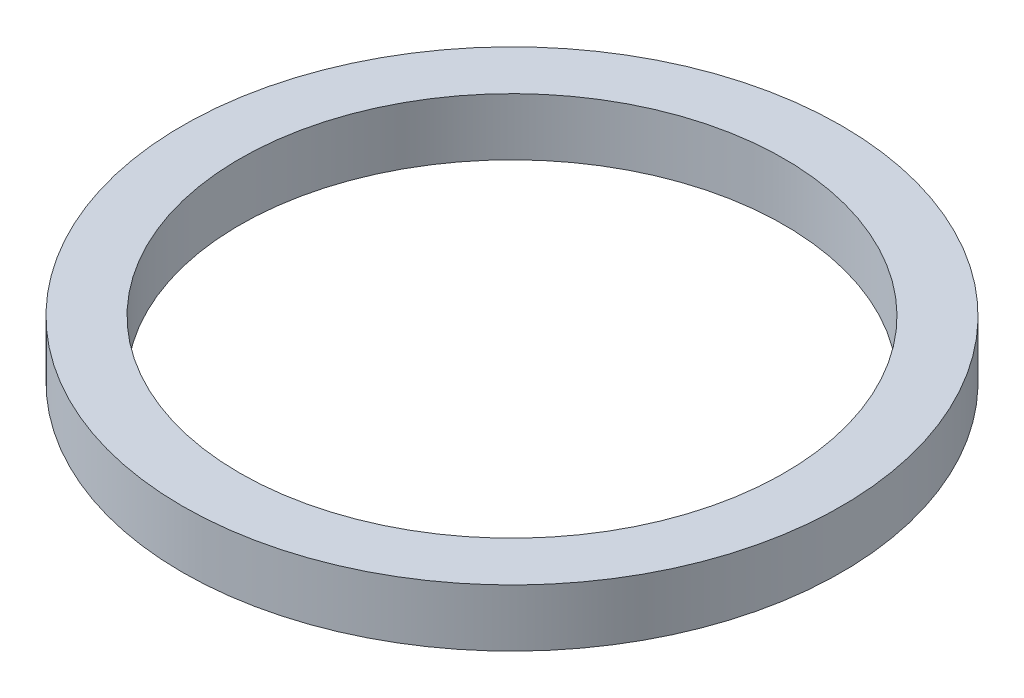
ISO-10303-21;
HEADER;
FILE_DESCRIPTION(('STEP AP214'),'2;1');
FILE_NAME('part.step','',(''),(''),'','','');
FILE_SCHEMA(('AUTOMOTIVE_DESIGN { 1 0 10303 214 1 1 1 1 }'));
ENDSEC;
DATA;
#1=APPLICATION_CONTEXT('core data for automotive mechanical design processes');
#2=APPLICATION_PROTOCOL_DEFINITION('international standard','automotive_design',2000,#1);
#3=PRODUCT_CONTEXT('',#1,'mechanical');
#4=PRODUCT('Part','Part','',(#3));
#5=PRODUCT_RELATED_PRODUCT_CATEGORY('part','',(#4));
#6=PRODUCT_DEFINITION_FORMATION('','',#4);
#7=PRODUCT_DEFINITION_CONTEXT('part definition',#1,'design');
#8=PRODUCT_DEFINITION('design','',#6,#7);
#9=PRODUCT_DEFINITION_SHAPE('','',#8);
#10=(LENGTH_UNIT() NAMED_UNIT(*) SI_UNIT(.MILLI.,.METRE.));
#11=(NAMED_UNIT(*) PLANE_ANGLE_UNIT() SI_UNIT($,.RADIAN.));
#12=(NAMED_UNIT(*) SI_UNIT($,.STERADIAN.) SOLID_ANGLE_UNIT());
#13=UNCERTAINTY_MEASURE_WITH_UNIT(LENGTH_MEASURE(1.E-05),#10,'distance_accuracy_value','');
#14=(GEOMETRIC_REPRESENTATION_CONTEXT(3) GLOBAL_UNCERTAINTY_ASSIGNED_CONTEXT((#13)) GLOBAL_UNIT_ASSIGNED_CONTEXT((#10,
#11,#12)) REPRESENTATION_CONTEXT('',''));
#15=CARTESIAN_POINT('',(0.,0.,0.));
#16=DIRECTION('',(0.,0.,1.));
#17=DIRECTION('',(1.,0.,0.));
#18=AXIS2_PLACEMENT_3D('',#15,#16,#17);
#19=CARTESIAN_POINT('',(0.,10.,0.));
#20=DIRECTION('',(0.,-1.,0.));
#21=DIRECTION('',(0.,0.,-1.));
#22=AXIS2_PLACEMENT_3D('',#19,#20,#21);
#23=CYLINDRICAL_SURFACE('',#22,57.5);
#24=CARTESIAN_POINT('',(0.,10.,0.));
#25=DIRECTION('',(0.,1.,0.));
#26=DIRECTION('',(0.,0.,1.));
#27=AXIS2_PLACEMENT_3D('',#24,#25,#26);
#28=CIRCLE('',#27,57.5);
#29=CARTESIAN_POINT('',(0.,10.,57.5));
#30=VERTEX_POINT('',#29);
#31=EDGE_CURVE('E10',#30,#30,#28,.T.);
#32=ORIENTED_EDGE('',*,*,#31,.F.);
#33=EDGE_LOOP('',(#32));
#34=FACE_BOUND('',#33,.T.);
#35=CARTESIAN_POINT('',(0.,0.,0.));
#36=DIRECTION('',(0.,1.,0.));
#37=DIRECTION('',(0.,0.,1.));
#38=AXIS2_PLACEMENT_3D('',#35,#36,#37);
#39=CIRCLE('',#38,57.5);
#40=CARTESIAN_POINT('',(0.,0.,57.5));
#41=VERTEX_POINT('',#40);
#42=EDGE_CURVE('E37',#41,#41,#39,.T.);
#43=ORIENTED_EDGE('',*,*,#42,.T.);
#44=EDGE_LOOP('',(#43));
#45=FACE_BOUND('',#44,.T.);
#46=ADVANCED_FACE('F40',(#34,#45),#23,.T.);
#47=CARTESIAN_POINT('',(0.,10.,0.));
#48=DIRECTION('',(0.,1.,0.));
#49=DIRECTION('',(0.,0.,1.));
#50=AXIS2_PLACEMENT_3D('',#47,#48,#49);
#51=PLANE('',#50);
#52=CARTESIAN_POINT('',(0.,10.,0.));
#53=DIRECTION('',(0.,1.,0.));
#54=DIRECTION('',(0.,0.,1.));
#55=AXIS2_PLACEMENT_3D('',#52,#53,#54);
#56=CIRCLE('',#55,47.5);
#57=CARTESIAN_POINT('',(0.,10.,47.5));
#58=VERTEX_POINT('',#57);
#59=EDGE_CURVE('E50',#58,#58,#56,.T.);
#60=ORIENTED_EDGE('',*,*,#59,.F.);
#61=EDGE_LOOP('',(#60));
#62=FACE_BOUND('',#61,.T.);
#63=ORIENTED_EDGE('',*,*,#31,.T.);
#64=EDGE_LOOP('',(#63));
#65=FACE_BOUND('',#64,.T.);
#66=ADVANCED_FACE('F59',(#62,#65),#51,.T.);
#67=CARTESIAN_POINT('',(0.,0.,0.));
#68=DIRECTION('',(0.,1.,0.));
#69=DIRECTION('',(0.,0.,1.));
#70=AXIS2_PLACEMENT_3D('',#67,#68,#69);
#71=PLANE('',#70);
#72=CARTESIAN_POINT('',(0.,0.,0.));
#73=DIRECTION('',(0.,1.,0.));
#74=DIRECTION('',(0.,0.,1.));
#75=AXIS2_PLACEMENT_3D('',#72,#73,#74);
#76=CIRCLE('',#75,47.5);
#77=CARTESIAN_POINT('',(0.,0.,47.5));
#78=VERTEX_POINT('',#77);
#79=EDGE_CURVE('E47',#78,#78,#76,.T.);
#80=ORIENTED_EDGE('',*,*,#79,.T.);
#81=EDGE_LOOP('',(#80));
#82=FACE_BOUND('',#81,.T.);
#83=ORIENTED_EDGE('',*,*,#42,.F.);
#84=EDGE_LOOP('',(#83));
#85=FACE_BOUND('',#84,.T.);
#86=ADVANCED_FACE('F58',(#82,#85),#71,.F.);
#87=CARTESIAN_POINT('',(0.,10.,0.));
#88=DIRECTION('',(0.,-1.,0.));
#89=DIRECTION('',(0.,0.,-1.));
#90=AXIS2_PLACEMENT_3D('',#87,#88,#89);
#91=CYLINDRICAL_SURFACE('',#90,47.5);
#92=ORIENTED_EDGE('',*,*,#59,.T.);
#93=EDGE_LOOP('',(#92));
#94=FACE_BOUND('',#93,.T.);
#95=ORIENTED_EDGE('',*,*,#79,.F.);
#96=EDGE_LOOP('',(#95));
#97=FACE_BOUND('',#96,.T.);
#98=ADVANCED_FACE('F54',(#94,#97),#91,.F.);
#99=CLOSED_SHELL('',(#46,#66,#86,#98));
#100=MANIFOLD_SOLID_BREP('B2',#99);
#101=ADVANCED_BREP_SHAPE_REPRESENTATION('',(#18,#100),#14);
#102=SHAPE_DEFINITION_REPRESENTATION(#9,#101);
ENDSEC;
END-ISO-10303-21;
